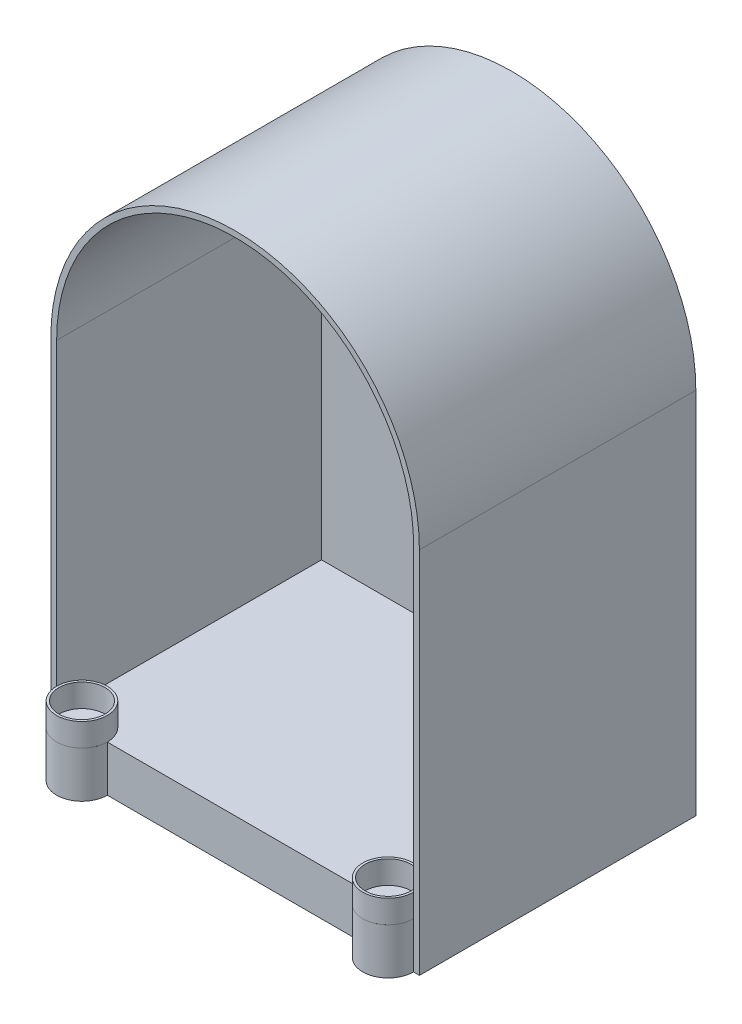
ISO-10303-21;
HEADER;
FILE_DESCRIPTION(('STEP AP214'),'2;1');
FILE_NAME('part.step','',(''),(''),'','','');
FILE_SCHEMA(('AUTOMOTIVE_DESIGN { 1 0 10303 214 1 1 1 1 }'));
ENDSEC;
DATA;
#1=APPLICATION_CONTEXT('core data for automotive mechanical design processes');
#2=APPLICATION_PROTOCOL_DEFINITION('international standard','automotive_design',2000,#1);
#3=PRODUCT_CONTEXT('',#1,'mechanical');
#4=PRODUCT('Part','Part','',(#3));
#5=PRODUCT_RELATED_PRODUCT_CATEGORY('part','',(#4));
#6=PRODUCT_DEFINITION_FORMATION('','',#4);
#7=PRODUCT_DEFINITION_CONTEXT('part definition',#1,'design');
#8=PRODUCT_DEFINITION('design','',#6,#7);
#9=PRODUCT_DEFINITION_SHAPE('','',#8);
#10=(LENGTH_UNIT() NAMED_UNIT(*) SI_UNIT(.MILLI.,.METRE.));
#11=(NAMED_UNIT(*) PLANE_ANGLE_UNIT() SI_UNIT($,.RADIAN.));
#12=(NAMED_UNIT(*) SI_UNIT($,.STERADIAN.) SOLID_ANGLE_UNIT());
#13=UNCERTAINTY_MEASURE_WITH_UNIT(LENGTH_MEASURE(1.E-05),#10,'distance_accuracy_value','');
#14=(GEOMETRIC_REPRESENTATION_CONTEXT(3) GLOBAL_UNCERTAINTY_ASSIGNED_CONTEXT((#13)) GLOBAL_UNIT_ASSIGNED_CONTEXT((#10,
#11,#12)) REPRESENTATION_CONTEXT('',''));
#15=CARTESIAN_POINT('',(0.,0.,0.));
#16=DIRECTION('',(0.,0.,1.));
#17=DIRECTION('',(1.,0.,0.));
#18=AXIS2_PLACEMENT_3D('',#15,#16,#17);
#19=CARTESIAN_POINT('',(185.928,38.1,152.4));
#20=DIRECTION('',(0.,-1.,0.));
#21=DIRECTION('',(0.,0.,-1.));
#22=AXIS2_PLACEMENT_3D('',#19,#20,#21);
#23=CYLINDRICAL_SURFACE('',#22,13.97);
#24=CARTESIAN_POINT('',(185.928,38.1,152.4));
#25=DIRECTION('',(0.,1.,0.));
#26=DIRECTION('',(0.,0.,1.));
#27=AXIS2_PLACEMENT_3D('',#24,#25,#26);
#28=CIRCLE('',#27,13.97);
#29=CARTESIAN_POINT('',(185.928,38.1,166.37));
#30=VERTEX_POINT('',#29);
#31=EDGE_CURVE('E11',#30,#30,#28,.T.);
#32=ORIENTED_EDGE('',*,*,#31,.F.);
#33=EDGE_LOOP('',(#32));
#34=FACE_BOUND('',#33,.T.);
#35=CARTESIAN_POINT('',(185.928,25.4,152.4));
#36=DIRECTION('',(0.,1.,0.));
#37=DIRECTION('',(0.,0.,1.));
#38=AXIS2_PLACEMENT_3D('',#35,#36,#37);
#39=CIRCLE('',#38,13.97);
#40=CARTESIAN_POINT('',(185.928,25.4,166.37));
#41=VERTEX_POINT('',#40);
#42=EDGE_CURVE('E46',#41,#41,#39,.T.);
#43=ORIENTED_EDGE('',*,*,#42,.T.);
#44=EDGE_LOOP('',(#43));
#45=FACE_BOUND('',#44,.T.);
#46=ADVANCED_FACE('F43',(#34,#45),#23,.T.);
#47=CARTESIAN_POINT('',(185.928,38.1,152.4));
#48=DIRECTION('',(0.,1.,0.));
#49=DIRECTION('',(0.,0.,1.));
#50=AXIS2_PLACEMENT_3D('',#47,#48,#49);
#51=PLANE('',#50);
#52=CARTESIAN_POINT('',(185.928,38.1,152.4));
#53=DIRECTION('',(0.,1.,0.));
#54=DIRECTION('',(0.,0.,1.));
#55=AXIS2_PLACEMENT_3D('',#52,#53,#54);
#56=CIRCLE('',#55,12.7);
#57=CARTESIAN_POINT('',(185.928,38.1,165.1));
#58=VERTEX_POINT('',#57);
#59=EDGE_CURVE('E55',#58,#58,#56,.T.);
#60=ORIENTED_EDGE('',*,*,#59,.F.);
#61=EDGE_LOOP('',(#60));
#62=FACE_BOUND('',#61,.T.);
#63=ORIENTED_EDGE('',*,*,#31,.T.);
#64=EDGE_LOOP('',(#63));
#65=FACE_BOUND('',#64,.T.);
#66=ADVANCED_FACE('F70',(#62,#65),#51,.T.);
#67=CARTESIAN_POINT('',(185.928,25.4,152.4));
#68=DIRECTION('',(0.,1.,0.));
#69=DIRECTION('',(0.,0.,1.));
#70=AXIS2_PLACEMENT_3D('',#67,#68,#69);
#71=PLANE('',#70);
#72=CARTESIAN_POINT('',(185.928,25.4,152.4));
#73=DIRECTION('',(0.,1.,0.));
#74=DIRECTION('',(0.,0.,1.));
#75=AXIS2_PLACEMENT_3D('',#72,#73,#74);
#76=CIRCLE('',#75,12.7);
#77=CARTESIAN_POINT('',(185.928,25.4,165.1));
#78=VERTEX_POINT('',#77);
#79=EDGE_CURVE('E53',#78,#78,#76,.T.);
#80=ORIENTED_EDGE('',*,*,#79,.T.);
#81=EDGE_LOOP('',(#80));
#82=FACE_BOUND('',#81,.T.);
#83=ORIENTED_EDGE('',*,*,#42,.F.);
#84=EDGE_LOOP('',(#83));
#85=FACE_BOUND('',#84,.T.);
#86=ADVANCED_FACE('F61',(#82,#85),#71,.F.);
#87=CARTESIAN_POINT('',(185.928,25.4,152.4));
#88=DIRECTION('',(0.,1.,0.));
#89=DIRECTION('',(0.,0.,1.));
#90=AXIS2_PLACEMENT_3D('',#87,#88,#89);
#91=CYLINDRICAL_SURFACE('',#90,12.7);
#92=ORIENTED_EDGE('',*,*,#79,.F.);
#93=EDGE_LOOP('',(#92));
#94=FACE_BOUND('',#93,.T.);
#95=ORIENTED_EDGE('',*,*,#59,.T.);
#96=EDGE_LOOP('',(#95));
#97=FACE_BOUND('',#96,.T.);
#98=ADVANCED_FACE('F64',(#94,#97),#91,.F.);
#99=CLOSED_SHELL('',(#46,#66,#86,#98));
#100=MANIFOLD_SOLID_BREP('B2',#99);
#101=CARTESIAN_POINT('',(17.145,38.1,152.4));
#102=DIRECTION('',(0.,-1.,0.));
#103=DIRECTION('',(0.,0.,-1.));
#104=AXIS2_PLACEMENT_3D('',#101,#102,#103);
#105=CYLINDRICAL_SURFACE('',#104,13.9700000000003);
#106=CARTESIAN_POINT('',(17.145,38.1,152.4));
#107=DIRECTION('',(0.,1.,0.));
#108=DIRECTION('',(0.,0.,1.));
#109=AXIS2_PLACEMENT_3D('',#106,#107,#108);
#110=CIRCLE('',#109,13.9700000000003);
#111=CARTESIAN_POINT('',(17.145,38.1,166.37));
#112=VERTEX_POINT('',#111);
#113=EDGE_CURVE('E42',#112,#112,#110,.T.);
#114=ORIENTED_EDGE('',*,*,#113,.F.);
#115=EDGE_LOOP('',(#114));
#116=FACE_BOUND('',#115,.T.);
#117=CARTESIAN_POINT('',(17.145,25.4,152.4));
#118=DIRECTION('',(0.,1.,0.));
#119=DIRECTION('',(0.,0.,1.));
#120=AXIS2_PLACEMENT_3D('',#117,#118,#119);
#121=CIRCLE('',#120,13.9700000000003);
#122=CARTESIAN_POINT('',(17.145,25.4,166.37));
#123=VERTEX_POINT('',#122);
#124=EDGE_CURVE('E116',#123,#123,#121,.T.);
#125=ORIENTED_EDGE('',*,*,#124,.T.);
#126=EDGE_LOOP('',(#125));
#127=FACE_BOUND('',#126,.T.);
#128=ADVANCED_FACE('F113',(#116,#127),#105,.T.);
#129=CARTESIAN_POINT('',(17.145,38.1,152.4));
#130=DIRECTION('',(0.,1.,0.));
#131=DIRECTION('',(0.,0.,1.));
#132=AXIS2_PLACEMENT_3D('',#129,#130,#131);
#133=PLANE('',#132);
#134=CARTESIAN_POINT('',(17.145,38.1,152.4));
#135=DIRECTION('',(0.,1.,0.));
#136=DIRECTION('',(0.,0.,1.));
#137=AXIS2_PLACEMENT_3D('',#134,#135,#136);
#138=CIRCLE('',#137,12.7);
#139=CARTESIAN_POINT('',(17.145,38.1,165.1));
#140=VERTEX_POINT('',#139);
#141=EDGE_CURVE('E125',#140,#140,#138,.T.);
#142=ORIENTED_EDGE('',*,*,#141,.F.);
#143=EDGE_LOOP('',(#142));
#144=FACE_BOUND('',#143,.T.);
#145=ORIENTED_EDGE('',*,*,#113,.T.);
#146=EDGE_LOOP('',(#145));
#147=FACE_BOUND('',#146,.T.);
#148=ADVANCED_FACE('F140',(#144,#147),#133,.T.);
#149=CARTESIAN_POINT('',(17.145,25.4,152.4));
#150=DIRECTION('',(0.,1.,0.));
#151=DIRECTION('',(0.,0.,1.));
#152=AXIS2_PLACEMENT_3D('',#149,#150,#151);
#153=PLANE('',#152);
#154=CARTESIAN_POINT('',(17.145,25.4,152.4));
#155=DIRECTION('',(0.,1.,0.));
#156=DIRECTION('',(0.,0.,1.));
#157=AXIS2_PLACEMENT_3D('',#154,#155,#156);
#158=CIRCLE('',#157,12.7);
#159=CARTESIAN_POINT('',(17.145,25.4,165.1));
#160=VERTEX_POINT('',#159);
#161=EDGE_CURVE('E123',#160,#160,#158,.T.);
#162=ORIENTED_EDGE('',*,*,#161,.T.);
#163=EDGE_LOOP('',(#162));
#164=FACE_BOUND('',#163,.T.);
#165=ORIENTED_EDGE('',*,*,#124,.F.);
#166=EDGE_LOOP('',(#165));
#167=FACE_BOUND('',#166,.T.);
#168=ADVANCED_FACE('F131',(#164,#167),#153,.F.);
#169=CARTESIAN_POINT('',(17.145,25.4,152.4));
#170=DIRECTION('',(0.,1.,0.));
#171=DIRECTION('',(0.,0.,1.));
#172=AXIS2_PLACEMENT_3D('',#169,#170,#171);
#173=CYLINDRICAL_SURFACE('',#172,12.7);
#174=ORIENTED_EDGE('',*,*,#161,.F.);
#175=EDGE_LOOP('',(#174));
#176=FACE_BOUND('',#175,.T.);
#177=ORIENTED_EDGE('',*,*,#141,.T.);
#178=EDGE_LOOP('',(#177));
#179=FACE_BOUND('',#178,.T.);
#180=ADVANCED_FACE('F134',(#176,#179),#173,.F.);
#181=CLOSED_SHELL('',(#128,#148,#168,#180));
#182=MANIFOLD_SOLID_BREP('B6',#181);
#183=CARTESIAN_POINT('',(101.6,203.2,152.4));
#184=DIRECTION('',(0.,0.,-1.));
#185=DIRECTION('',(-1.,0.,0.));
#186=AXIS2_PLACEMENT_3D('',#183,#184,#185);
#187=PLANE('',#186);
#188=DIRECTION('',(0.,-1.,0.));
#189=VECTOR('',#188,1.);
#190=CARTESIAN_POINT('',(199.898,25.4,152.4));
#191=LINE('',#190,#189);
#192=CARTESIAN_POINT('',(199.898,25.4,152.4));
#193=VERTEX_POINT('',#192);
#194=CARTESIAN_POINT('',(199.898,0.,152.4));
#195=VERTEX_POINT('',#194);
#196=EDGE_CURVE('E189',#193,#195,#191,.T.);
#197=ORIENTED_EDGE('',*,*,#196,.T.);
#198=DIRECTION('',(1.,0.,0.));
#199=VECTOR('',#198,1.);
#200=CARTESIAN_POINT('',(0.,0.,152.4));
#201=LINE('',#200,#199);
#202=CARTESIAN_POINT('',(203.2,0.,152.4));
#203=VERTEX_POINT('',#202);
#204=EDGE_CURVE('E305',#195,#203,#201,.T.);
#205=ORIENTED_EDGE('',*,*,#204,.T.);
#206=DIRECTION('',(0.,1.,0.));
#207=VECTOR('',#206,1.);
#208=CARTESIAN_POINT('',(203.2,0.,152.4));
#209=LINE('',#208,#207);
#210=CARTESIAN_POINT('',(203.2,203.2,152.4));
#211=VERTEX_POINT('',#210);
#212=EDGE_CURVE('E309',#203,#211,#209,.T.);
#213=ORIENTED_EDGE('',*,*,#212,.T.);
#214=CARTESIAN_POINT('',(101.6,203.2,152.4));
#215=DIRECTION('',(0.,0.,1.));
#216=DIRECTION('',(-1.,0.,0.));
#217=AXIS2_PLACEMENT_3D('',#214,#215,#216);
#218=CIRCLE('',#217,101.6);
#219=CARTESIAN_POINT('',(0.,203.2,152.4));
#220=VERTEX_POINT('',#219);
#221=EDGE_CURVE('E299',#211,#220,#218,.T.);
#222=ORIENTED_EDGE('',*,*,#221,.T.);
#223=DIRECTION('',(0.,-1.,0.));
#224=VECTOR('',#223,1.);
#225=CARTESIAN_POINT('',(0.,203.2,152.4));
#226=LINE('',#225,#224);
#227=CARTESIAN_POINT('',(0.,0.,152.4));
#228=VERTEX_POINT('',#227);
#229=EDGE_CURVE('E302',#220,#228,#226,.T.);
#230=ORIENTED_EDGE('',*,*,#229,.T.);
#231=CARTESIAN_POINT('',(3.17499999999941,0.,152.4));
#232=VERTEX_POINT('',#231);
#233=EDGE_CURVE('E306',#228,#232,#201,.T.);
#234=ORIENTED_EDGE('',*,*,#233,.T.);
#235=DIRECTION('',(0.,-1.,0.));
#236=VECTOR('',#235,1.);
#237=CARTESIAN_POINT('',(3.17499999999941,25.4,152.4));
#238=LINE('',#237,#236);
#239=CARTESIAN_POINT('',(3.17499999999941,25.4,152.4));
#240=VERTEX_POINT('',#239);
#241=EDGE_CURVE('E349',#240,#232,#238,.T.);
#242=ORIENTED_EDGE('',*,*,#241,.F.);
#243=DIRECTION('',(0.,-1.,0.));
#244=VECTOR('',#243,1.);
#245=CARTESIAN_POINT('',(3.17500000000003,203.2,152.4));
#246=LINE('',#245,#244);
#247=CARTESIAN_POINT('',(3.17500000000003,203.2,152.4));
#248=VERTEX_POINT('',#247);
#249=EDGE_CURVE('E283',#248,#240,#246,.T.);
#250=ORIENTED_EDGE('',*,*,#249,.F.);
#251=CARTESIAN_POINT('',(101.6,203.2,152.4));
#252=DIRECTION('',(0.,0.,1.));
#253=DIRECTION('',(-1.,0.,0.));
#254=AXIS2_PLACEMENT_3D('',#251,#252,#253);
#255=CIRCLE('',#254,98.425);
#256=CARTESIAN_POINT('',(200.025,203.2,152.4));
#257=VERTEX_POINT('',#256);
#258=EDGE_CURVE('E354',#257,#248,#255,.T.);
#259=ORIENTED_EDGE('',*,*,#258,.F.);
#260=DIRECTION('',(0.,1.,0.));
#261=VECTOR('',#260,1.);
#262=CARTESIAN_POINT('',(200.025,25.4,152.4));
#263=LINE('',#262,#261);
#264=CARTESIAN_POINT('',(200.025,25.4,152.4));
#265=VERTEX_POINT('',#264);
#266=EDGE_CURVE('E277',#265,#257,#263,.T.);
#267=ORIENTED_EDGE('',*,*,#266,.F.);
#268=DIRECTION('',(1.,0.,0.));
#269=VECTOR('',#268,1.);
#270=CARTESIAN_POINT('',(3.17500000000003,25.4,152.4));
#271=LINE('',#270,#269);
#272=EDGE_CURVE('E278',#193,#265,#271,.T.);
#273=ORIENTED_EDGE('',*,*,#272,.F.);
#274=EDGE_LOOP('',(#197,#205,#213,#222,#230,#234,#242,#250,#259,#267,#273));
#275=FACE_BOUND('',#274,.T.);
#276=ADVANCED_FACE('F174',(#275),#187,.F.);
#277=DIRECTION('',(0.,-1.,0.));
#278=VECTOR('',#277,1.);
#279=CARTESIAN_POINT('',(171.958,25.4,152.4));
#280=LINE('',#279,#278);
#281=CARTESIAN_POINT('',(171.958,25.4,152.4));
#282=VERTEX_POINT('',#281);
#283=CARTESIAN_POINT('',(171.958,0.,152.4));
#284=VERTEX_POINT('',#283);
#285=EDGE_CURVE('E261',#282,#284,#280,.T.);
#286=ORIENTED_EDGE('',*,*,#285,.F.);
#287=CARTESIAN_POINT('',(31.115,25.4,152.4));
#288=VERTEX_POINT('',#287);
#289=EDGE_CURVE('E271',#288,#282,#271,.T.);
#290=ORIENTED_EDGE('',*,*,#289,.F.);
#291=DIRECTION('',(0.,-1.,0.));
#292=VECTOR('',#291,1.);
#293=CARTESIAN_POINT('',(31.115,25.4,152.4));
#294=LINE('',#293,#292);
#295=CARTESIAN_POINT('',(31.115,0.,152.4));
#296=VERTEX_POINT('',#295);
#297=EDGE_CURVE('E352',#288,#296,#294,.T.);
#298=ORIENTED_EDGE('',*,*,#297,.T.);
#299=EDGE_CURVE('E273',#296,#284,#201,.T.);
#300=ORIENTED_EDGE('',*,*,#299,.T.);
#301=EDGE_LOOP('',(#286,#290,#298,#300));
#302=FACE_BOUND('',#301,.T.);
#303=ADVANCED_FACE('F269',(#302),#187,.F.);
#304=CARTESIAN_POINT('',(101.6,203.2,152.4));
#305=DIRECTION('',(0.,0.,-1.));
#306=DIRECTION('',(-1.,0.,0.));
#307=AXIS2_PLACEMENT_3D('',#304,#305,#306);
#308=CYLINDRICAL_SURFACE('',#307,101.6);
#309=CARTESIAN_POINT('',(101.6,203.2,0.));
#310=DIRECTION('',(0.,0.,1.));
#311=DIRECTION('',(-1.,0.,0.));
#312=AXIS2_PLACEMENT_3D('',#309,#310,#311);
#313=CIRCLE('',#312,101.6);
#314=CARTESIAN_POINT('',(203.2,203.2,0.));
#315=VERTEX_POINT('',#314);
#316=CARTESIAN_POINT('',(0.,203.2,0.));
#317=VERTEX_POINT('',#316);
#318=EDGE_CURVE('E289',#315,#317,#313,.T.);
#319=ORIENTED_EDGE('',*,*,#318,.T.);
#320=DIRECTION('',(0.,0.,-1.));
#321=VECTOR('',#320,1.);
#322=CARTESIAN_POINT('',(0.,203.2,152.4));
#323=LINE('',#322,#321);
#324=EDGE_CURVE('E111',#220,#317,#323,.T.);
#325=ORIENTED_EDGE('',*,*,#324,.F.);
#326=ORIENTED_EDGE('',*,*,#221,.F.);
#327=DIRECTION('',(0.,0.,-1.));
#328=VECTOR('',#327,1.);
#329=CARTESIAN_POINT('',(203.2,203.2,152.4));
#330=LINE('',#329,#328);
#331=EDGE_CURVE('E311',#211,#315,#330,.T.);
#332=ORIENTED_EDGE('',*,*,#331,.T.);
#333=EDGE_LOOP('',(#319,#325,#326,#332));
#334=FACE_BOUND('',#333,.T.);
#335=ADVANCED_FACE('F176',(#334),#308,.T.);
#336=CARTESIAN_POINT('',(0.,203.2,152.4));
#337=DIRECTION('',(1.,0.,0.));
#338=DIRECTION('',(0.,1.,0.));
#339=AXIS2_PLACEMENT_3D('',#336,#337,#338);
#340=PLANE('',#339);
#341=DIRECTION('',(0.,-1.,0.));
#342=VECTOR('',#341,1.);
#343=CARTESIAN_POINT('',(0.,203.2,0.));
#344=LINE('',#343,#342);
#345=CARTESIAN_POINT('',(0.,0.,0.));
#346=VERTEX_POINT('',#345);
#347=EDGE_CURVE('E314',#317,#346,#344,.T.);
#348=ORIENTED_EDGE('',*,*,#347,.T.);
#349=DIRECTION('',(0.,0.,-1.));
#350=VECTOR('',#349,1.);
#351=CARTESIAN_POINT('',(0.,0.,152.4));
#352=LINE('',#351,#350);
#353=EDGE_CURVE('E182',#228,#346,#352,.T.);
#354=ORIENTED_EDGE('',*,*,#353,.F.);
#355=ORIENTED_EDGE('',*,*,#229,.F.);
#356=ORIENTED_EDGE('',*,*,#324,.T.);
#357=EDGE_LOOP('',(#348,#354,#355,#356));
#358=FACE_BOUND('',#357,.T.);
#359=ADVANCED_FACE('F403',(#358),#340,.F.);
#360=CARTESIAN_POINT('',(0.,0.,152.4));
#361=DIRECTION('',(0.,1.,0.));
#362=DIRECTION('',(0.,0.,1.));
#363=AXIS2_PLACEMENT_3D('',#360,#361,#362);
#364=PLANE('',#363);
#365=DIRECTION('',(1.,0.,0.));
#366=VECTOR('',#365,1.);
#367=CARTESIAN_POINT('',(0.,0.,0.));
#368=LINE('',#367,#366);
#369=CARTESIAN_POINT('',(203.2,0.,0.));
#370=VERTEX_POINT('',#369);
#371=EDGE_CURVE('E316',#346,#370,#368,.T.);
#372=ORIENTED_EDGE('',*,*,#371,.T.);
#373=DIRECTION('',(0.,0.,-1.));
#374=VECTOR('',#373,1.);
#375=CARTESIAN_POINT('',(203.2,0.,152.4));
#376=LINE('',#375,#374);
#377=EDGE_CURVE('E321',#203,#370,#376,.T.);
#378=ORIENTED_EDGE('',*,*,#377,.F.);
#379=ORIENTED_EDGE('',*,*,#204,.F.);
#380=CARTESIAN_POINT('',(185.928,0.,152.4));
#381=DIRECTION('',(0.,1.,0.));
#382=DIRECTION('',(0.,0.,1.));
#383=AXIS2_PLACEMENT_3D('',#380,#381,#382);
#384=CIRCLE('',#383,13.97);
#385=EDGE_CURVE('E264',#284,#195,#384,.T.);
#386=ORIENTED_EDGE('',*,*,#385,.F.);
#387=ORIENTED_EDGE('',*,*,#299,.F.);
#388=CARTESIAN_POINT('',(17.145,0.,152.4));
#389=DIRECTION('',(0.,1.,0.));
#390=DIRECTION('',(0.,0.,1.));
#391=AXIS2_PLACEMENT_3D('',#388,#389,#390);
#392=CIRCLE('',#391,13.9700000000003);
#393=EDGE_CURVE('E274',#296,#232,#392,.F.);
#394=ORIENTED_EDGE('',*,*,#393,.T.);
#395=ORIENTED_EDGE('',*,*,#233,.F.);
#396=ORIENTED_EDGE('',*,*,#353,.T.);
#397=EDGE_LOOP('',(#372,#378,#379,#386,#387,#394,#395,#396));
#398=FACE_BOUND('',#397,.T.);
#399=ADVANCED_FACE('F328',(#398),#364,.F.);
#400=CARTESIAN_POINT('',(203.2,0.,152.4));
#401=DIRECTION('',(-1.,0.,0.));
#402=DIRECTION('',(0.,0.,1.));
#403=AXIS2_PLACEMENT_3D('',#400,#401,#402);
#404=PLANE('',#403);
#405=DIRECTION('',(0.,1.,0.));
#406=VECTOR('',#405,1.);
#407=CARTESIAN_POINT('',(203.2,0.,0.));
#408=LINE('',#407,#406);
#409=EDGE_CURVE('E303',#370,#315,#408,.T.);
#410=ORIENTED_EDGE('',*,*,#409,.T.);
#411=ORIENTED_EDGE('',*,*,#331,.F.);
#412=ORIENTED_EDGE('',*,*,#212,.F.);
#413=ORIENTED_EDGE('',*,*,#377,.T.);
#414=EDGE_LOOP('',(#410,#411,#412,#413));
#415=FACE_BOUND('',#414,.T.);
#416=ADVANCED_FACE('F338',(#415),#404,.F.);
#417=CARTESIAN_POINT('',(101.6,203.2,0.));
#418=DIRECTION('',(0.,0.,-1.));
#419=DIRECTION('',(-1.,0.,0.));
#420=AXIS2_PLACEMENT_3D('',#417,#418,#419);
#421=PLANE('',#420);
#422=ORIENTED_EDGE('',*,*,#318,.F.);
#423=ORIENTED_EDGE('',*,*,#409,.F.);
#424=ORIENTED_EDGE('',*,*,#371,.F.);
#425=ORIENTED_EDGE('',*,*,#347,.F.);
#426=EDGE_LOOP('',(#422,#423,#424,#425));
#427=FACE_BOUND('',#426,.T.);
#428=ADVANCED_FACE('F335',(#427),#421,.T.);
#429=CARTESIAN_POINT('',(101.6,203.2,6.35000000000002));
#430=DIRECTION('',(0.,0.,1.));
#431=DIRECTION('',(1.,0.,0.));
#432=AXIS2_PLACEMENT_3D('',#429,#430,#431);
#433=CYLINDRICAL_SURFACE('',#432,98.425);
#434=ORIENTED_EDGE('',*,*,#258,.T.);
#435=DIRECTION('',(0.,0.,1.));
#436=VECTOR('',#435,1.);
#437=CARTESIAN_POINT('',(3.17500000000003,203.2,6.35000000000002));
#438=LINE('',#437,#436);
#439=CARTESIAN_POINT('',(3.17500000000003,203.2,6.35000000000002));
#440=VERTEX_POINT('',#439);
#441=EDGE_CURVE('E295',#440,#248,#438,.T.);
#442=ORIENTED_EDGE('',*,*,#441,.F.);
#443=CARTESIAN_POINT('',(101.6,203.2,6.35000000000002));
#444=DIRECTION('',(0.,0.,1.));
#445=DIRECTION('',(-1.,0.,0.));
#446=AXIS2_PLACEMENT_3D('',#443,#444,#445);
#447=CIRCLE('',#446,98.425);
#448=CARTESIAN_POINT('',(200.025,203.2,6.35000000000002));
#449=VERTEX_POINT('',#448);
#450=EDGE_CURVE('E281',#449,#440,#447,.T.);
#451=ORIENTED_EDGE('',*,*,#450,.F.);
#452=DIRECTION('',(0.,0.,1.));
#453=VECTOR('',#452,1.);
#454=CARTESIAN_POINT('',(200.025,203.2,6.35000000000002));
#455=LINE('',#454,#453);
#456=EDGE_CURVE('E287',#449,#257,#455,.T.);
#457=ORIENTED_EDGE('',*,*,#456,.T.);
#458=EDGE_LOOP('',(#434,#442,#451,#457));
#459=FACE_BOUND('',#458,.T.);
#460=ADVANCED_FACE('F379',(#459),#433,.F.);
#461=CARTESIAN_POINT('',(200.025,25.4,6.35000000000002));
#462=DIRECTION('',(1.,0.,0.));
#463=DIRECTION('',(0.,0.,-1.));
#464=AXIS2_PLACEMENT_3D('',#461,#462,#463);
#465=PLANE('',#464);
#466=ORIENTED_EDGE('',*,*,#266,.T.);
#467=ORIENTED_EDGE('',*,*,#456,.F.);
#468=DIRECTION('',(0.,1.,0.));
#469=VECTOR('',#468,1.);
#470=CARTESIAN_POINT('',(200.025,25.4,6.35000000000002));
#471=LINE('',#470,#469);
#472=CARTESIAN_POINT('',(200.025,25.4,6.35000000000002));
#473=VERTEX_POINT('',#472);
#474=EDGE_CURVE('E298',#473,#449,#471,.T.);
#475=ORIENTED_EDGE('',*,*,#474,.F.);
#476=DIRECTION('',(0.,0.,1.));
#477=VECTOR('',#476,1.);
#478=CARTESIAN_POINT('',(200.025,25.4,6.35000000000002));
#479=LINE('',#478,#477);
#480=EDGE_CURVE('E290',#473,#265,#479,.T.);
#481=ORIENTED_EDGE('',*,*,#480,.T.);
#482=EDGE_LOOP('',(#466,#467,#475,#481));
#483=FACE_BOUND('',#482,.T.);
#484=ADVANCED_FACE('F381',(#483),#465,.F.);
#485=CARTESIAN_POINT('',(3.17500000000003,25.4,6.35000000000002));
#486=DIRECTION('',(0.,-1.,0.));
#487=DIRECTION('',(0.,0.,-1.));
#488=AXIS2_PLACEMENT_3D('',#485,#486,#487);
#489=PLANE('',#488);
#490=DIRECTION('',(0.,0.,1.));
#491=VECTOR('',#490,1.);
#492=CARTESIAN_POINT('',(3.17500000000003,25.4,6.35000000000002));
#493=LINE('',#492,#491);
#494=CARTESIAN_POINT('',(3.17500000000003,25.4,6.35000000000002));
#495=VERTEX_POINT('',#494);
#496=EDGE_CURVE('E293',#495,#240,#493,.T.);
#497=ORIENTED_EDGE('',*,*,#496,.T.);
#498=CARTESIAN_POINT('',(17.145,25.4,152.4));
#499=DIRECTION('',(0.,1.,0.));
#500=DIRECTION('',(0.,0.,1.));
#501=AXIS2_PLACEMENT_3D('',#498,#499,#500);
#502=CIRCLE('',#501,13.9700000000003);
#503=EDGE_CURVE('E197',#288,#240,#502,.F.);
#504=ORIENTED_EDGE('',*,*,#503,.F.);
#505=ORIENTED_EDGE('',*,*,#289,.T.);
#506=CARTESIAN_POINT('',(185.928,25.4,152.4));
#507=DIRECTION('',(0.,1.,0.));
#508=DIRECTION('',(0.,0.,1.));
#509=AXIS2_PLACEMENT_3D('',#506,#507,#508);
#510=CIRCLE('',#509,13.97);
#511=EDGE_CURVE('E258',#282,#193,#510,.T.);
#512=ORIENTED_EDGE('',*,*,#511,.T.);
#513=ORIENTED_EDGE('',*,*,#272,.T.);
#514=ORIENTED_EDGE('',*,*,#480,.F.);
#515=DIRECTION('',(1.,0.,0.));
#516=VECTOR('',#515,1.);
#517=CARTESIAN_POINT('',(3.17500000000003,25.4,6.35000000000002));
#518=LINE('',#517,#516);
#519=EDGE_CURVE('E360',#495,#473,#518,.T.);
#520=ORIENTED_EDGE('',*,*,#519,.F.);
#521=EDGE_LOOP('',(#497,#504,#505,#512,#513,#514,#520));
#522=FACE_BOUND('',#521,.T.);
#523=ADVANCED_FACE('F276',(#522),#489,.F.);
#524=CARTESIAN_POINT('',(3.17500000000003,203.2,6.35000000000002));
#525=DIRECTION('',(-1.,0.,0.));
#526=DIRECTION('',(0.,-1.,0.));
#527=AXIS2_PLACEMENT_3D('',#524,#525,#526);
#528=PLANE('',#527);
#529=ORIENTED_EDGE('',*,*,#249,.T.);
#530=ORIENTED_EDGE('',*,*,#496,.F.);
#531=DIRECTION('',(0.,-1.,0.));
#532=VECTOR('',#531,1.);
#533=CARTESIAN_POINT('',(3.17500000000003,203.2,6.35000000000002));
#534=LINE('',#533,#532);
#535=EDGE_CURVE('E357',#440,#495,#534,.T.);
#536=ORIENTED_EDGE('',*,*,#535,.F.);
#537=ORIENTED_EDGE('',*,*,#441,.T.);
#538=EDGE_LOOP('',(#529,#530,#536,#537));
#539=FACE_BOUND('',#538,.T.);
#540=ADVANCED_FACE('F369',(#539),#528,.F.);
#541=CARTESIAN_POINT('',(101.6,203.2,6.35000000000002));
#542=DIRECTION('',(0.,0.,-1.));
#543=DIRECTION('',(-1.,0.,0.));
#544=AXIS2_PLACEMENT_3D('',#541,#542,#543);
#545=PLANE('',#544);
#546=ORIENTED_EDGE('',*,*,#450,.T.);
#547=ORIENTED_EDGE('',*,*,#535,.T.);
#548=ORIENTED_EDGE('',*,*,#519,.T.);
#549=ORIENTED_EDGE('',*,*,#474,.T.);
#550=EDGE_LOOP('',(#546,#547,#548,#549));
#551=FACE_BOUND('',#550,.T.);
#552=ADVANCED_FACE('F377',(#551),#545,.F.);
#553=CARTESIAN_POINT('',(17.145,25.4,152.4));
#554=DIRECTION('',(0.,-1.,0.));
#555=DIRECTION('',(0.,0.,-1.));
#556=AXIS2_PLACEMENT_3D('',#553,#554,#555);
#557=CYLINDRICAL_SURFACE('',#556,13.9700000000003);
#558=ORIENTED_EDGE('',*,*,#393,.F.);
#559=ORIENTED_EDGE('',*,*,#297,.F.);
#560=ORIENTED_EDGE('',*,*,#503,.T.);
#561=ORIENTED_EDGE('',*,*,#241,.T.);
#562=EDGE_LOOP('',(#558,#559,#560,#561));
#563=FACE_BOUND('',#562,.T.);
#564=ADVANCED_FACE('F447',(#563),#557,.T.);
#565=CARTESIAN_POINT('',(185.928,25.4,152.4));
#566=DIRECTION('',(0.,-1.,0.));
#567=DIRECTION('',(0.,0.,-1.));
#568=AXIS2_PLACEMENT_3D('',#565,#566,#567);
#569=CYLINDRICAL_SURFACE('',#568,13.97);
#570=ORIENTED_EDGE('',*,*,#385,.T.);
#571=ORIENTED_EDGE('',*,*,#196,.F.);
#572=ORIENTED_EDGE('',*,*,#511,.F.);
#573=ORIENTED_EDGE('',*,*,#285,.T.);
#574=EDGE_LOOP('',(#570,#571,#572,#573));
#575=FACE_BOUND('',#574,.T.);
#576=ADVANCED_FACE('F260',(#575),#569,.T.);
#577=CLOSED_SHELL('',(#276,#303,#335,#359,#399,#416,#428,#460,#484,#523,#540,#552,#564,#576));
#578=MANIFOLD_SOLID_BREP('B37',#577);
#579=ADVANCED_BREP_SHAPE_REPRESENTATION('',(#18,#100,#182,#578),#14);
#580=SHAPE_DEFINITION_REPRESENTATION(#9,#579);
ENDSEC;
END-ISO-10303-21;
